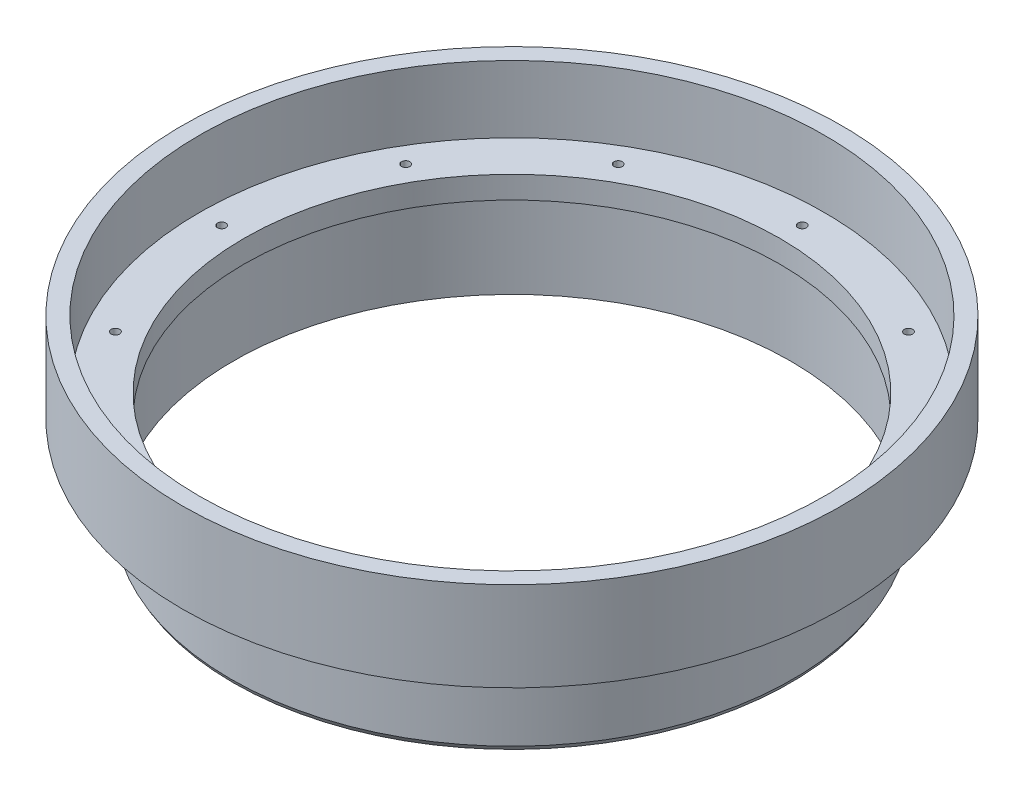
ISO-10303-21;
HEADER;
FILE_DESCRIPTION(('STEP AP214'),'2;1');
FILE_NAME('part.step','',(''),(''),'','','');
FILE_SCHEMA(('AUTOMOTIVE_DESIGN { 1 0 10303 214 1 1 1 1 }'));
ENDSEC;
DATA;
#1=APPLICATION_CONTEXT('core data for automotive mechanical design processes');
#2=APPLICATION_PROTOCOL_DEFINITION('international standard','automotive_design',2000,#1);
#3=PRODUCT_CONTEXT('',#1,'mechanical');
#4=PRODUCT('Part','Part','',(#3));
#5=PRODUCT_RELATED_PRODUCT_CATEGORY('part','',(#4));
#6=PRODUCT_DEFINITION_FORMATION('','',#4);
#7=PRODUCT_DEFINITION_CONTEXT('part definition',#1,'design');
#8=PRODUCT_DEFINITION('design','',#6,#7);
#9=PRODUCT_DEFINITION_SHAPE('','',#8);
#10=(LENGTH_UNIT() NAMED_UNIT(*) SI_UNIT(.MILLI.,.METRE.));
#11=(NAMED_UNIT(*) PLANE_ANGLE_UNIT() SI_UNIT($,.RADIAN.));
#12=(NAMED_UNIT(*) SI_UNIT($,.STERADIAN.) SOLID_ANGLE_UNIT());
#13=UNCERTAINTY_MEASURE_WITH_UNIT(LENGTH_MEASURE(1.E-05),#10,'distance_accuracy_value','');
#14=(GEOMETRIC_REPRESENTATION_CONTEXT(3) GLOBAL_UNCERTAINTY_ASSIGNED_CONTEXT((#13)) GLOBAL_UNIT_ASSIGNED_CONTEXT((#10,
#11,#12)) REPRESENTATION_CONTEXT('',''));
#15=CARTESIAN_POINT('',(0.,0.,0.));
#16=DIRECTION('',(0.,0.,1.));
#17=DIRECTION('',(1.,0.,0.));
#18=AXIS2_PLACEMENT_3D('',#15,#16,#17);
#19=CARTESIAN_POINT('',(-44.45,0.,0.));
#20=DIRECTION('',(0.,1.,0.));
#21=DIRECTION('',(0.,0.,1.));
#22=AXIS2_PLACEMENT_3D('',#19,#20,#21);
#23=PLANE('',#22);
#24=CARTESIAN_POINT('',(-35.7451985412029,0.,20.6374999999996));
#25=DIRECTION('',(0.,1.,0.));
#26=DIRECTION('',(0.,0.,1.));
#27=AXIS2_PLACEMENT_3D('',#24,#25,#26);
#28=CIRCLE('',#27,0.59563);
#29=CARTESIAN_POINT('',(-35.7451985412029,0.,21.2331299999996));
#30=VERTEX_POINT('',#29);
#31=EDGE_CURVE('E141',#30,#30,#28,.T.);
#32=ORIENTED_EDGE('',*,*,#31,.F.);
#33=EDGE_LOOP('',(#32));
#34=FACE_BOUND('',#33,.T.);
#35=CARTESIAN_POINT('',(-20.6375000000004,0.,35.7451985412025));
#36=DIRECTION('',(0.,1.,0.));
#37=DIRECTION('',(0.,0.,1.));
#38=AXIS2_PLACEMENT_3D('',#35,#36,#37);
#39=CIRCLE('',#38,0.59563);
#40=CARTESIAN_POINT('',(-20.6375000000004,0.,36.3408285412025));
#41=VERTEX_POINT('',#40);
#42=EDGE_CURVE('E135',#41,#41,#39,.T.);
#43=ORIENTED_EDGE('',*,*,#42,.F.);
#44=EDGE_LOOP('',(#43));
#45=FACE_BOUND('',#44,.T.);
#46=CARTESIAN_POINT('',(-3.53958818572525E-13,0.,41.275));
#47=DIRECTION('',(0.,1.,0.));
#48=DIRECTION('',(0.,0.,1.));
#49=AXIS2_PLACEMENT_3D('',#46,#47,#48);
#50=CIRCLE('',#49,0.595629999999999);
#51=CARTESIAN_POINT('',(-3.53958818572525E-13,0.,41.87063));
#52=VERTEX_POINT('',#51);
#53=EDGE_CURVE('E129',#52,#52,#50,.T.);
#54=ORIENTED_EDGE('',*,*,#53,.F.);
#55=EDGE_LOOP('',(#54));
#56=FACE_BOUND('',#55,.T.);
#57=CARTESIAN_POINT('',(20.6374999999997,0.,35.7451985412029));
#58=DIRECTION('',(0.,1.,0.));
#59=DIRECTION('',(0.,0.,1.));
#60=AXIS2_PLACEMENT_3D('',#57,#58,#59);
#61=CIRCLE('',#60,0.59563);
#62=CARTESIAN_POINT('',(20.6374999999997,0.,36.3408285412029));
#63=VERTEX_POINT('',#62);
#64=EDGE_CURVE('E123',#63,#63,#61,.T.);
#65=ORIENTED_EDGE('',*,*,#64,.F.);
#66=EDGE_LOOP('',(#65));
#67=FACE_BOUND('',#66,.T.);
#68=CARTESIAN_POINT('',(35.7451985412026,0.,20.6375000000002));
#69=DIRECTION('',(0.,1.,0.));
#70=DIRECTION('',(0.,0.,1.));
#71=AXIS2_PLACEMENT_3D('',#68,#69,#70);
#72=CIRCLE('',#71,0.59563);
#73=CARTESIAN_POINT('',(35.7451985412026,0.,21.2331300000002));
#74=VERTEX_POINT('',#73);
#75=EDGE_CURVE('E117',#74,#74,#72,.T.);
#76=ORIENTED_EDGE('',*,*,#75,.F.);
#77=EDGE_LOOP('',(#76));
#78=FACE_BOUND('',#77,.T.);
#79=CARTESIAN_POINT('',(41.275,0.,2.28177708448336E-13));
#80=DIRECTION('',(0.,1.,0.));
#81=DIRECTION('',(0.,0.,1.));
#82=AXIS2_PLACEMENT_3D('',#79,#80,#81);
#83=CIRCLE('',#82,0.59563);
#84=CARTESIAN_POINT('',(41.275,0.,0.595630000000228));
#85=VERTEX_POINT('',#84);
#86=EDGE_CURVE('E111',#85,#85,#83,.T.);
#87=ORIENTED_EDGE('',*,*,#86,.F.);
#88=EDGE_LOOP('',(#87));
#89=FACE_BOUND('',#88,.T.);
#90=CARTESIAN_POINT('',(35.7451985412028,0.,-20.6374999999998));
#91=DIRECTION('',(0.,1.,0.));
#92=DIRECTION('',(0.,0.,1.));
#93=AXIS2_PLACEMENT_3D('',#90,#91,#92);
#94=CIRCLE('',#93,0.59563);
#95=CARTESIAN_POINT('',(35.7451985412028,0.,-20.0418699999998));
#96=VERTEX_POINT('',#95);
#97=EDGE_CURVE('E105',#96,#96,#94,.T.);
#98=ORIENTED_EDGE('',*,*,#97,.F.);
#99=EDGE_LOOP('',(#98));
#100=FACE_BOUND('',#99,.T.);
#101=CARTESIAN_POINT('',(20.6375000000001,0.,-35.7451985412026));
#102=DIRECTION('',(0.,1.,0.));
#103=DIRECTION('',(0.,0.,1.));
#104=AXIS2_PLACEMENT_3D('',#101,#102,#103);
#105=CIRCLE('',#104,0.59563);
#106=CARTESIAN_POINT('',(20.6375000000001,0.,-35.1495685412026));
#107=VERTEX_POINT('',#106);
#108=EDGE_CURVE('E99',#107,#107,#105,.T.);
#109=ORIENTED_EDGE('',*,*,#108,.F.);
#110=EDGE_LOOP('',(#109));
#111=FACE_BOUND('',#110,.T.);
#112=CARTESIAN_POINT('',(1.11561489392428E-13,0.,-41.275));
#113=DIRECTION('',(0.,1.,0.));
#114=DIRECTION('',(0.,0.,1.));
#115=AXIS2_PLACEMENT_3D('',#112,#113,#114);
#116=CIRCLE('',#115,0.595629999999999);
#117=CARTESIAN_POINT('',(1.11561489392428E-13,0.,-40.67937));
#118=VERTEX_POINT('',#117);
#119=EDGE_CURVE('E93',#118,#118,#116,.T.);
#120=ORIENTED_EDGE('',*,*,#119,.F.);
#121=EDGE_LOOP('',(#120));
#122=FACE_BOUND('',#121,.T.);
#123=CARTESIAN_POINT('',(-20.6374999999999,0.,-35.7451985412027));
#124=DIRECTION('',(0.,1.,0.));
#125=DIRECTION('',(0.,0.,1.));
#126=AXIS2_PLACEMENT_3D('',#123,#124,#125);
#127=CIRCLE('',#126,0.59563);
#128=CARTESIAN_POINT('',(-20.6374999999999,0.,-35.1495685412027));
#129=VERTEX_POINT('',#128);
#130=EDGE_CURVE('E87',#129,#129,#127,.T.);
#131=ORIENTED_EDGE('',*,*,#130,.F.);
#132=EDGE_LOOP('',(#131));
#133=FACE_BOUND('',#132,.T.);
#134=CARTESIAN_POINT('',(-35.7451985412027,0.,-20.6375));
#135=DIRECTION('',(0.,1.,0.));
#136=DIRECTION('',(0.,0.,1.));
#137=AXIS2_PLACEMENT_3D('',#134,#135,#136);
#138=CIRCLE('',#137,0.59563);
#139=CARTESIAN_POINT('',(-35.7451985412027,0.,-20.04187));
#140=VERTEX_POINT('',#139);
#141=EDGE_CURVE('E81',#140,#140,#138,.T.);
#142=ORIENTED_EDGE('',*,*,#141,.F.);
#143=EDGE_LOOP('',(#142));
#144=FACE_BOUND('',#143,.T.);
#145=CARTESIAN_POINT('',(-41.275,0.,0.));
#146=DIRECTION('',(0.,1.,0.));
#147=DIRECTION('',(0.,0.,1.));
#148=AXIS2_PLACEMENT_3D('',#145,#146,#147);
#149=CIRCLE('',#148,0.59563);
#150=CARTESIAN_POINT('',(-41.275,0.,0.595630000000005));
#151=VERTEX_POINT('',#150);
#152=EDGE_CURVE('E75',#151,#151,#149,.T.);
#153=ORIENTED_EDGE('',*,*,#152,.F.);
#154=EDGE_LOOP('',(#153));
#155=FACE_BOUND('',#154,.T.);
#156=CARTESIAN_POINT('',(0.,0.,0.));
#157=DIRECTION('',(0.,1.,0.));
#158=DIRECTION('',(0.,0.,1.));
#159=AXIS2_PLACEMENT_3D('',#156,#157,#158);
#160=CIRCLE('',#159,44.45);
#161=CARTESIAN_POINT('',(0.,0.,44.45));
#162=VERTEX_POINT('',#161);
#163=EDGE_CURVE('E69',#162,#162,#160,.T.);
#164=ORIENTED_EDGE('',*,*,#163,.T.);
#165=EDGE_LOOP('',(#164));
#166=FACE_BOUND('',#165,.T.);
#167=CARTESIAN_POINT('',(0.,0.,0.));
#168=DIRECTION('',(0.,1.,0.));
#169=DIRECTION('',(0.,0.,1.));
#170=AXIS2_PLACEMENT_3D('',#167,#168,#169);
#171=CIRCLE('',#170,38.1);
#172=CARTESIAN_POINT('',(0.,0.,38.1));
#173=VERTEX_POINT('',#172);
#174=EDGE_CURVE('E10',#173,#173,#171,.T.);
#175=ORIENTED_EDGE('',*,*,#174,.F.);
#176=EDGE_LOOP('',(#175));
#177=FACE_BOUND('',#176,.T.);
#178=ADVANCED_FACE('F35',(#34,#45,#56,#67,#78,#89,#100,#111,#122,#133,#144,#155,#166,#177),#23,.T.);
#179=CARTESIAN_POINT('',(0.,55.,0.));
#180=DIRECTION('',(0.,1.,0.));
#181=DIRECTION('',(0.,0.,1.));
#182=AXIS2_PLACEMENT_3D('',#179,#180,#181);
#183=CYLINDRICAL_SURFACE('',#182,38.1);
#184=ORIENTED_EDGE('',*,*,#174,.T.);
#185=EDGE_LOOP('',(#184));
#186=FACE_BOUND('',#185,.T.);
#187=CARTESIAN_POINT('',(0.,-3.175,0.));
#188=DIRECTION('',(0.,1.,0.));
#189=DIRECTION('',(0.,0.,1.));
#190=AXIS2_PLACEMENT_3D('',#187,#188,#189);
#191=CIRCLE('',#190,38.1);
#192=CARTESIAN_POINT('',(0.,-3.175,38.1));
#193=VERTEX_POINT('',#192);
#194=EDGE_CURVE('E41',#193,#193,#191,.T.);
#195=ORIENTED_EDGE('',*,*,#194,.F.);
#196=EDGE_LOOP('',(#195));
#197=FACE_BOUND('',#196,.T.);
#198=ADVANCED_FACE('F149',(#186,#197),#183,.F.);
#199=CARTESIAN_POINT('',(-38.1,-3.175,0.));
#200=DIRECTION('',(0.,-1.,0.));
#201=DIRECTION('',(0.,0.,-1.));
#202=AXIS2_PLACEMENT_3D('',#199,#200,#201);
#203=PLANE('',#202);
#204=ORIENTED_EDGE('',*,*,#194,.T.);
#205=EDGE_LOOP('',(#204));
#206=FACE_BOUND('',#205,.T.);
#207=CARTESIAN_POINT('',(0.,-3.175,0.));
#208=DIRECTION('',(0.,1.,0.));
#209=DIRECTION('',(0.,0.,1.));
#210=AXIS2_PLACEMENT_3D('',#207,#208,#209);
#211=CIRCLE('',#210,39.624);
#212=CARTESIAN_POINT('',(0.,-3.175,39.624));
#213=VERTEX_POINT('',#212);
#214=EDGE_CURVE('E45',#213,#213,#211,.T.);
#215=ORIENTED_EDGE('',*,*,#214,.F.);
#216=EDGE_LOOP('',(#215));
#217=FACE_BOUND('',#216,.T.);
#218=ADVANCED_FACE('F211',(#206,#217),#203,.T.);
#219=CARTESIAN_POINT('',(0.,55.,0.));
#220=DIRECTION('',(0.,1.,0.));
#221=DIRECTION('',(0.,0.,1.));
#222=AXIS2_PLACEMENT_3D('',#219,#220,#221);
#223=CYLINDRICAL_SURFACE('',#222,39.624);
#224=ORIENTED_EDGE('',*,*,#214,.T.);
#225=EDGE_LOOP('',(#224));
#226=FACE_BOUND('',#225,.T.);
#227=CARTESIAN_POINT('',(0.,-15.875,0.));
#228=DIRECTION('',(0.,1.,0.));
#229=DIRECTION('',(0.,0.,1.));
#230=AXIS2_PLACEMENT_3D('',#227,#228,#229);
#231=CIRCLE('',#230,39.624);
#232=CARTESIAN_POINT('',(0.,-15.875,39.624));
#233=VERTEX_POINT('',#232);
#234=EDGE_CURVE('E49',#233,#233,#231,.T.);
#235=ORIENTED_EDGE('',*,*,#234,.F.);
#236=EDGE_LOOP('',(#235));
#237=FACE_BOUND('',#236,.T.);
#238=ADVANCED_FACE('F207',(#226,#237),#223,.F.);
#239=CARTESIAN_POINT('',(0.,-15.2150886423163,0.));
#240=DIRECTION('',(0.,1.,0.));
#241=DIRECTION('',(0.,0.,1.));
#242=AXIS2_PLACEMENT_3D('',#239,#240,#241);
#243=CONICAL_SURFACE('',#242,40.005,0.523598775598298);
#244=ORIENTED_EDGE('',*,*,#234,.T.);
#245=EDGE_LOOP('',(#244));
#246=FACE_BOUND('',#245,.T.);
#247=CARTESIAN_POINT('',(0.,-15.2150886423163,0.));
#248=DIRECTION('',(0.,1.,0.));
#249=DIRECTION('',(0.,0.,1.));
#250=AXIS2_PLACEMENT_3D('',#247,#248,#249);
#251=CIRCLE('',#250,40.005);
#252=CARTESIAN_POINT('',(0.,-15.2150886423163,40.005));
#253=VERTEX_POINT('',#252);
#254=EDGE_CURVE('E54',#253,#253,#251,.T.);
#255=ORIENTED_EDGE('',*,*,#254,.F.);
#256=EDGE_LOOP('',(#255));
#257=FACE_BOUND('',#256,.T.);
#258=ADVANCED_FACE('F203',(#246,#257),#243,.T.);
#259=CARTESIAN_POINT('',(0.,55.,0.));
#260=DIRECTION('',(0.,1.,0.));
#261=DIRECTION('',(0.,0.,1.));
#262=AXIS2_PLACEMENT_3D('',#259,#260,#261);
#263=CYLINDRICAL_SURFACE('',#262,40.005);
#264=ORIENTED_EDGE('',*,*,#254,.T.);
#265=EDGE_LOOP('',(#264));
#266=FACE_BOUND('',#265,.T.);
#267=CARTESIAN_POINT('',(0.,-3.175,0.));
#268=DIRECTION('',(0.,1.,0.));
#269=DIRECTION('',(0.,0.,1.));
#270=AXIS2_PLACEMENT_3D('',#267,#268,#269);
#271=CIRCLE('',#270,40.005);
#272=CARTESIAN_POINT('',(0.,-3.175,40.005));
#273=VERTEX_POINT('',#272);
#274=EDGE_CURVE('E57',#273,#273,#271,.T.);
#275=ORIENTED_EDGE('',*,*,#274,.F.);
#276=EDGE_LOOP('',(#275));
#277=FACE_BOUND('',#276,.T.);
#278=ADVANCED_FACE('F199',(#266,#277),#263,.T.);
#279=CARTESIAN_POINT('',(-40.005,-3.175,0.));
#280=DIRECTION('',(0.,-1.,0.));
#281=DIRECTION('',(0.,0.,-1.));
#282=AXIS2_PLACEMENT_3D('',#279,#280,#281);
#283=PLANE('',#282);
#284=CARTESIAN_POINT('',(-35.7451985412029,-3.175,20.6374999999996));
#285=DIRECTION('',(0.,1.,0.));
#286=DIRECTION('',(0.,0.,1.));
#287=AXIS2_PLACEMENT_3D('',#284,#285,#286);
#288=CIRCLE('',#287,0.59563);
#289=CARTESIAN_POINT('',(-35.7451985412029,-3.175,21.2331299999996));
#290=VERTEX_POINT('',#289);
#291=EDGE_CURVE('E138',#290,#290,#288,.T.);
#292=ORIENTED_EDGE('',*,*,#291,.T.);
#293=EDGE_LOOP('',(#292));
#294=FACE_BOUND('',#293,.T.);
#295=CARTESIAN_POINT('',(-20.6375000000004,-3.175,35.7451985412025));
#296=DIRECTION('',(0.,1.,0.));
#297=DIRECTION('',(0.,0.,1.));
#298=AXIS2_PLACEMENT_3D('',#295,#296,#297);
#299=CIRCLE('',#298,0.59563);
#300=CARTESIAN_POINT('',(-20.6375000000004,-3.175,36.3408285412025));
#301=VERTEX_POINT('',#300);
#302=EDGE_CURVE('E132',#301,#301,#299,.T.);
#303=ORIENTED_EDGE('',*,*,#302,.T.);
#304=EDGE_LOOP('',(#303));
#305=FACE_BOUND('',#304,.T.);
#306=CARTESIAN_POINT('',(-3.53958818572525E-13,-3.175,41.275));
#307=DIRECTION('',(0.,1.,0.));
#308=DIRECTION('',(0.,0.,1.));
#309=AXIS2_PLACEMENT_3D('',#306,#307,#308);
#310=CIRCLE('',#309,0.595629999999999);
#311=CARTESIAN_POINT('',(-3.53958818572525E-13,-3.175,41.87063));
#312=VERTEX_POINT('',#311);
#313=EDGE_CURVE('E126',#312,#312,#310,.T.);
#314=ORIENTED_EDGE('',*,*,#313,.T.);
#315=EDGE_LOOP('',(#314));
#316=FACE_BOUND('',#315,.T.);
#317=CARTESIAN_POINT('',(20.6374999999997,-3.175,35.7451985412029));
#318=DIRECTION('',(0.,1.,0.));
#319=DIRECTION('',(0.,0.,1.));
#320=AXIS2_PLACEMENT_3D('',#317,#318,#319);
#321=CIRCLE('',#320,0.59563);
#322=CARTESIAN_POINT('',(20.6374999999997,-3.175,36.3408285412029));
#323=VERTEX_POINT('',#322);
#324=EDGE_CURVE('E120',#323,#323,#321,.T.);
#325=ORIENTED_EDGE('',*,*,#324,.T.);
#326=EDGE_LOOP('',(#325));
#327=FACE_BOUND('',#326,.T.);
#328=CARTESIAN_POINT('',(35.7451985412026,-3.175,20.6375000000002));
#329=DIRECTION('',(0.,1.,0.));
#330=DIRECTION('',(0.,0.,1.));
#331=AXIS2_PLACEMENT_3D('',#328,#329,#330);
#332=CIRCLE('',#331,0.59563);
#333=CARTESIAN_POINT('',(35.7451985412026,-3.175,21.2331300000002));
#334=VERTEX_POINT('',#333);
#335=EDGE_CURVE('E114',#334,#334,#332,.T.);
#336=ORIENTED_EDGE('',*,*,#335,.T.);
#337=EDGE_LOOP('',(#336));
#338=FACE_BOUND('',#337,.T.);
#339=CARTESIAN_POINT('',(41.275,-3.175,2.28177708448336E-13));
#340=DIRECTION('',(0.,1.,0.));
#341=DIRECTION('',(0.,0.,1.));
#342=AXIS2_PLACEMENT_3D('',#339,#340,#341);
#343=CIRCLE('',#342,0.59563);
#344=CARTESIAN_POINT('',(41.275,-3.175,0.595630000000228));
#345=VERTEX_POINT('',#344);
#346=EDGE_CURVE('E108',#345,#345,#343,.T.);
#347=ORIENTED_EDGE('',*,*,#346,.T.);
#348=EDGE_LOOP('',(#347));
#349=FACE_BOUND('',#348,.T.);
#350=CARTESIAN_POINT('',(35.7451985412028,-3.175,-20.6374999999998));
#351=DIRECTION('',(0.,1.,0.));
#352=DIRECTION('',(0.,0.,1.));
#353=AXIS2_PLACEMENT_3D('',#350,#351,#352);
#354=CIRCLE('',#353,0.59563);
#355=CARTESIAN_POINT('',(35.7451985412028,-3.175,-20.0418699999998));
#356=VERTEX_POINT('',#355);
#357=EDGE_CURVE('E102',#356,#356,#354,.T.);
#358=ORIENTED_EDGE('',*,*,#357,.T.);
#359=EDGE_LOOP('',(#358));
#360=FACE_BOUND('',#359,.T.);
#361=CARTESIAN_POINT('',(20.6375000000001,-3.175,-35.7451985412026));
#362=DIRECTION('',(0.,1.,0.));
#363=DIRECTION('',(0.,0.,1.));
#364=AXIS2_PLACEMENT_3D('',#361,#362,#363);
#365=CIRCLE('',#364,0.59563);
#366=CARTESIAN_POINT('',(20.6375000000001,-3.175,-35.1495685412026));
#367=VERTEX_POINT('',#366);
#368=EDGE_CURVE('E96',#367,#367,#365,.T.);
#369=ORIENTED_EDGE('',*,*,#368,.T.);
#370=EDGE_LOOP('',(#369));
#371=FACE_BOUND('',#370,.T.);
#372=CARTESIAN_POINT('',(1.11561489392428E-13,-3.175,-41.275));
#373=DIRECTION('',(0.,1.,0.));
#374=DIRECTION('',(0.,0.,1.));
#375=AXIS2_PLACEMENT_3D('',#372,#373,#374);
#376=CIRCLE('',#375,0.595629999999999);
#377=CARTESIAN_POINT('',(1.11561489392428E-13,-3.175,-40.67937));
#378=VERTEX_POINT('',#377);
#379=EDGE_CURVE('E90',#378,#378,#376,.T.);
#380=ORIENTED_EDGE('',*,*,#379,.T.);
#381=EDGE_LOOP('',(#380));
#382=FACE_BOUND('',#381,.T.);
#383=CARTESIAN_POINT('',(-20.6374999999999,-3.175,-35.7451985412027));
#384=DIRECTION('',(0.,1.,0.));
#385=DIRECTION('',(0.,0.,1.));
#386=AXIS2_PLACEMENT_3D('',#383,#384,#385);
#387=CIRCLE('',#386,0.59563);
#388=CARTESIAN_POINT('',(-20.6374999999999,-3.175,-35.1495685412027));
#389=VERTEX_POINT('',#388);
#390=EDGE_CURVE('E84',#389,#389,#387,.T.);
#391=ORIENTED_EDGE('',*,*,#390,.T.);
#392=EDGE_LOOP('',(#391));
#393=FACE_BOUND('',#392,.T.);
#394=CARTESIAN_POINT('',(-35.7451985412027,-3.175,-20.6375));
#395=DIRECTION('',(0.,1.,0.));
#396=DIRECTION('',(0.,0.,1.));
#397=AXIS2_PLACEMENT_3D('',#394,#395,#396);
#398=CIRCLE('',#397,0.59563);
#399=CARTESIAN_POINT('',(-35.7451985412027,-3.175,-20.04187));
#400=VERTEX_POINT('',#399);
#401=EDGE_CURVE('E78',#400,#400,#398,.T.);
#402=ORIENTED_EDGE('',*,*,#401,.T.);
#403=EDGE_LOOP('',(#402));
#404=FACE_BOUND('',#403,.T.);
#405=CARTESIAN_POINT('',(-41.275,-3.175,0.));
#406=DIRECTION('',(0.,1.,0.));
#407=DIRECTION('',(0.,0.,1.));
#408=AXIS2_PLACEMENT_3D('',#405,#406,#407);
#409=CIRCLE('',#408,0.59563);
#410=CARTESIAN_POINT('',(-41.275,-3.175,0.595630000000005));
#411=VERTEX_POINT('',#410);
#412=EDGE_CURVE('E72',#411,#411,#409,.T.);
#413=ORIENTED_EDGE('',*,*,#412,.T.);
#414=EDGE_LOOP('',(#413));
#415=FACE_BOUND('',#414,.T.);
#416=ORIENTED_EDGE('',*,*,#274,.T.);
#417=EDGE_LOOP('',(#416));
#418=FACE_BOUND('',#417,.T.);
#419=CARTESIAN_POINT('',(0.,-3.175,0.));
#420=DIRECTION('',(0.,1.,0.));
#421=DIRECTION('',(0.,0.,1.));
#422=AXIS2_PLACEMENT_3D('',#419,#420,#421);
#423=CIRCLE('',#422,46.863);
#424=CARTESIAN_POINT('',(0.,-3.175,46.863));
#425=VERTEX_POINT('',#424);
#426=EDGE_CURVE('E60',#425,#425,#423,.T.);
#427=ORIENTED_EDGE('',*,*,#426,.F.);
#428=EDGE_LOOP('',(#427));
#429=FACE_BOUND('',#428,.T.);
#430=ADVANCED_FACE('F195',(#294,#305,#316,#327,#338,#349,#360,#371,#382,#393,#404,#415,#418,
#429),#283,.T.);
#431=CARTESIAN_POINT('',(0.,55.,0.));
#432=DIRECTION('',(0.,1.,0.));
#433=DIRECTION('',(0.,0.,1.));
#434=AXIS2_PLACEMENT_3D('',#431,#432,#433);
#435=CYLINDRICAL_SURFACE('',#434,46.863);
#436=ORIENTED_EDGE('',*,*,#426,.T.);
#437=EDGE_LOOP('',(#436));
#438=FACE_BOUND('',#437,.T.);
#439=CARTESIAN_POINT('',(0.,9.525,0.));
#440=DIRECTION('',(0.,1.,0.));
#441=DIRECTION('',(0.,0.,1.));
#442=AXIS2_PLACEMENT_3D('',#439,#440,#441);
#443=CIRCLE('',#442,46.863);
#444=CARTESIAN_POINT('',(0.,9.525,46.863));
#445=VERTEX_POINT('',#444);
#446=EDGE_CURVE('E63',#445,#445,#443,.T.);
#447=ORIENTED_EDGE('',*,*,#446,.F.);
#448=EDGE_LOOP('',(#447));
#449=FACE_BOUND('',#448,.T.);
#450=ADVANCED_FACE('F188',(#438,#449),#435,.T.);
#451=CARTESIAN_POINT('',(-46.863,9.525,0.));
#452=DIRECTION('',(0.,1.,0.));
#453=DIRECTION('',(0.,0.,1.));
#454=AXIS2_PLACEMENT_3D('',#451,#452,#453);
#455=PLANE('',#454);
#456=ORIENTED_EDGE('',*,*,#446,.T.);
#457=EDGE_LOOP('',(#456));
#458=FACE_BOUND('',#457,.T.);
#459=CARTESIAN_POINT('',(0.,9.525,0.));
#460=DIRECTION('',(0.,1.,0.));
#461=DIRECTION('',(0.,0.,1.));
#462=AXIS2_PLACEMENT_3D('',#459,#460,#461);
#463=CIRCLE('',#462,44.45);
#464=CARTESIAN_POINT('',(0.,9.525,44.45));
#465=VERTEX_POINT('',#464);
#466=EDGE_CURVE('E66',#465,#465,#463,.T.);
#467=ORIENTED_EDGE('',*,*,#466,.F.);
#468=EDGE_LOOP('',(#467));
#469=FACE_BOUND('',#468,.T.);
#470=ADVANCED_FACE('F178',(#458,#469),#455,.T.);
#471=CARTESIAN_POINT('',(0.,55.,0.));
#472=DIRECTION('',(0.,1.,0.));
#473=DIRECTION('',(0.,0.,1.));
#474=AXIS2_PLACEMENT_3D('',#471,#472,#473);
#475=CYLINDRICAL_SURFACE('',#474,44.45);
#476=ORIENTED_EDGE('',*,*,#466,.T.);
#477=EDGE_LOOP('',(#476));
#478=FACE_BOUND('',#477,.T.);
#479=ORIENTED_EDGE('',*,*,#163,.F.);
#480=EDGE_LOOP('',(#479));
#481=FACE_BOUND('',#480,.T.);
#482=ADVANCED_FACE('F175',(#478,#481),#475,.F.);
#483=CARTESIAN_POINT('',(-41.275,0.,0.));
#484=DIRECTION('',(0.,1.,0.));
#485=DIRECTION('',(0.,0.,1.));
#486=AXIS2_PLACEMENT_3D('',#483,#484,#485);
#487=CYLINDRICAL_SURFACE('',#486,0.59563);
#488=ORIENTED_EDGE('',*,*,#412,.F.);
#489=EDGE_LOOP('',(#488));
#490=FACE_BOUND('',#489,.T.);
#491=ORIENTED_EDGE('',*,*,#152,.T.);
#492=EDGE_LOOP('',(#491));
#493=FACE_BOUND('',#492,.T.);
#494=ADVANCED_FACE('F177',(#490,#493),#487,.F.);
#495=CARTESIAN_POINT('',(-35.7451985412027,0.,-20.6375));
#496=DIRECTION('',(0.,1.,0.));
#497=DIRECTION('',(0.,0.,1.));
#498=AXIS2_PLACEMENT_3D('',#495,#496,#497);
#499=CYLINDRICAL_SURFACE('',#498,0.59563);
#500=ORIENTED_EDGE('',*,*,#401,.F.);
#501=EDGE_LOOP('',(#500));
#502=FACE_BOUND('',#501,.T.);
#503=ORIENTED_EDGE('',*,*,#141,.T.);
#504=EDGE_LOOP('',(#503));
#505=FACE_BOUND('',#504,.T.);
#506=ADVANCED_FACE('F185',(#502,#505),#499,.F.);
#507=CARTESIAN_POINT('',(-20.6374999999999,0.,-35.7451985412027));
#508=DIRECTION('',(0.,1.,0.));
#509=DIRECTION('',(0.,0.,1.));
#510=AXIS2_PLACEMENT_3D('',#507,#508,#509);
#511=CYLINDRICAL_SURFACE('',#510,0.59563);
#512=ORIENTED_EDGE('',*,*,#390,.F.);
#513=EDGE_LOOP('',(#512));
#514=FACE_BOUND('',#513,.T.);
#515=ORIENTED_EDGE('',*,*,#130,.T.);
#516=EDGE_LOOP('',(#515));
#517=FACE_BOUND('',#516,.T.);
#518=ADVANCED_FACE('F305',(#514,#517),#511,.F.);
#519=CARTESIAN_POINT('',(1.11561489392428E-13,0.,-41.275));
#520=DIRECTION('',(0.,1.,0.));
#521=DIRECTION('',(0.,0.,1.));
#522=AXIS2_PLACEMENT_3D('',#519,#520,#521);
#523=CYLINDRICAL_SURFACE('',#522,0.595629999999999);
#524=ORIENTED_EDGE('',*,*,#379,.F.);
#525=EDGE_LOOP('',(#524));
#526=FACE_BOUND('',#525,.T.);
#527=ORIENTED_EDGE('',*,*,#119,.T.);
#528=EDGE_LOOP('',(#527));
#529=FACE_BOUND('',#528,.T.);
#530=ADVANCED_FACE('F330',(#526,#529),#523,.F.);
#531=CARTESIAN_POINT('',(20.6375000000001,0.,-35.7451985412026));
#532=DIRECTION('',(0.,1.,0.));
#533=DIRECTION('',(0.,0.,1.));
#534=AXIS2_PLACEMENT_3D('',#531,#532,#533);
#535=CYLINDRICAL_SURFACE('',#534,0.59563);
#536=ORIENTED_EDGE('',*,*,#368,.F.);
#537=EDGE_LOOP('',(#536));
#538=FACE_BOUND('',#537,.T.);
#539=ORIENTED_EDGE('',*,*,#108,.T.);
#540=EDGE_LOOP('',(#539));
#541=FACE_BOUND('',#540,.T.);
#542=ADVANCED_FACE('F324',(#538,#541),#535,.F.);
#543=CARTESIAN_POINT('',(35.7451985412028,0.,-20.6374999999998));
#544=DIRECTION('',(0.,1.,0.));
#545=DIRECTION('',(0.,0.,1.));
#546=AXIS2_PLACEMENT_3D('',#543,#544,#545);
#547=CYLINDRICAL_SURFACE('',#546,0.59563);
#548=ORIENTED_EDGE('',*,*,#357,.F.);
#549=EDGE_LOOP('',(#548));
#550=FACE_BOUND('',#549,.T.);
#551=ORIENTED_EDGE('',*,*,#97,.T.);
#552=EDGE_LOOP('',(#551));
#553=FACE_BOUND('',#552,.T.);
#554=ADVANCED_FACE('F329',(#550,#553),#547,.F.);
#555=CARTESIAN_POINT('',(41.275,0.,2.28177708448336E-13));
#556=DIRECTION('',(0.,1.,0.));
#557=DIRECTION('',(0.,0.,1.));
#558=AXIS2_PLACEMENT_3D('',#555,#556,#557);
#559=CYLINDRICAL_SURFACE('',#558,0.59563);
#560=ORIENTED_EDGE('',*,*,#346,.F.);
#561=EDGE_LOOP('',(#560));
#562=FACE_BOUND('',#561,.T.);
#563=ORIENTED_EDGE('',*,*,#86,.T.);
#564=EDGE_LOOP('',(#563));
#565=FACE_BOUND('',#564,.T.);
#566=ADVANCED_FACE('F316',(#562,#565),#559,.F.);
#567=CARTESIAN_POINT('',(35.7451985412026,0.,20.6375000000002));
#568=DIRECTION('',(0.,1.,0.));
#569=DIRECTION('',(0.,0.,1.));
#570=AXIS2_PLACEMENT_3D('',#567,#568,#569);
#571=CYLINDRICAL_SURFACE('',#570,0.59563);
#572=ORIENTED_EDGE('',*,*,#335,.F.);
#573=EDGE_LOOP('',(#572));
#574=FACE_BOUND('',#573,.T.);
#575=ORIENTED_EDGE('',*,*,#75,.T.);
#576=EDGE_LOOP('',(#575));
#577=FACE_BOUND('',#576,.T.);
#578=ADVANCED_FACE('F311',(#574,#577),#571,.F.);
#579=CARTESIAN_POINT('',(20.6374999999997,0.,35.7451985412029));
#580=DIRECTION('',(0.,1.,0.));
#581=DIRECTION('',(0.,0.,1.));
#582=AXIS2_PLACEMENT_3D('',#579,#580,#581);
#583=CYLINDRICAL_SURFACE('',#582,0.59563);
#584=ORIENTED_EDGE('',*,*,#324,.F.);
#585=EDGE_LOOP('',(#584));
#586=FACE_BOUND('',#585,.T.);
#587=ORIENTED_EDGE('',*,*,#64,.T.);
#588=EDGE_LOOP('',(#587));
#589=FACE_BOUND('',#588,.T.);
#590=ADVANCED_FACE('F292',(#586,#589),#583,.F.);
#591=CARTESIAN_POINT('',(-3.53958818572525E-13,0.,41.275));
#592=DIRECTION('',(0.,1.,0.));
#593=DIRECTION('',(0.,0.,1.));
#594=AXIS2_PLACEMENT_3D('',#591,#592,#593);
#595=CYLINDRICAL_SURFACE('',#594,0.595629999999999);
#596=ORIENTED_EDGE('',*,*,#313,.F.);
#597=EDGE_LOOP('',(#596));
#598=FACE_BOUND('',#597,.T.);
#599=ORIENTED_EDGE('',*,*,#53,.T.);
#600=EDGE_LOOP('',(#599));
#601=FACE_BOUND('',#600,.T.);
#602=ADVANCED_FACE('F286',(#598,#601),#595,.F.);
#603=CARTESIAN_POINT('',(-20.6375000000004,0.,35.7451985412025));
#604=DIRECTION('',(0.,1.,0.));
#605=DIRECTION('',(0.,0.,1.));
#606=AXIS2_PLACEMENT_3D('',#603,#604,#605);
#607=CYLINDRICAL_SURFACE('',#606,0.59563);
#608=ORIENTED_EDGE('',*,*,#302,.F.);
#609=EDGE_LOOP('',(#608));
#610=FACE_BOUND('',#609,.T.);
#611=ORIENTED_EDGE('',*,*,#42,.T.);
#612=EDGE_LOOP('',(#611));
#613=FACE_BOUND('',#612,.T.);
#614=ADVANCED_FACE('F291',(#610,#613),#607,.F.);
#615=CARTESIAN_POINT('',(-35.7451985412029,0.,20.6374999999996));
#616=DIRECTION('',(0.,1.,0.));
#617=DIRECTION('',(0.,0.,1.));
#618=AXIS2_PLACEMENT_3D('',#615,#616,#617);
#619=CYLINDRICAL_SURFACE('',#618,0.59563);
#620=ORIENTED_EDGE('',*,*,#291,.F.);
#621=EDGE_LOOP('',(#620));
#622=FACE_BOUND('',#621,.T.);
#623=ORIENTED_EDGE('',*,*,#31,.T.);
#624=EDGE_LOOP('',(#623));
#625=FACE_BOUND('',#624,.T.);
#626=ADVANCED_FACE('F145',(#622,#625),#619,.F.);
#627=CLOSED_SHELL('',(#178,#198,#218,#238,#258,#278,#430,#450,#470,#482,#494,#506,#518,#530,
#542,#554,#566,#578,#590,#602,#614,#626));
#628=MANIFOLD_SOLID_BREP('B2',#627);
#629=ADVANCED_BREP_SHAPE_REPRESENTATION('',(#18,#628),#14);
#630=SHAPE_DEFINITION_REPRESENTATION(#9,#629);
ENDSEC;
END-ISO-10303-21;
